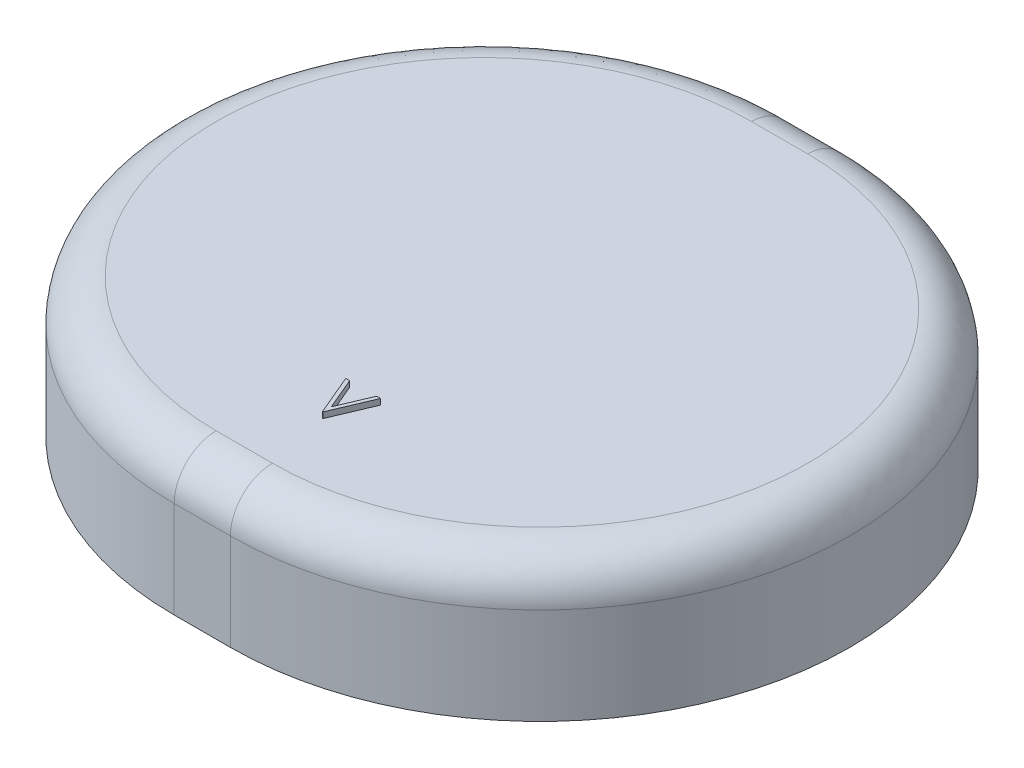
ISO-10303-21;
HEADER;
FILE_DESCRIPTION(('STEP AP214'),'2;1');
FILE_NAME('part.step','',(''),(''),'','','');
FILE_SCHEMA(('AUTOMOTIVE_DESIGN { 1 0 10303 214 1 1 1 1 }'));
ENDSEC;
DATA;
#1=APPLICATION_CONTEXT('core data for automotive mechanical design processes');
#2=APPLICATION_PROTOCOL_DEFINITION('international standard','automotive_design',2000,#1);
#3=PRODUCT_CONTEXT('',#1,'mechanical');
#4=PRODUCT('Part','Part','',(#3));
#5=PRODUCT_RELATED_PRODUCT_CATEGORY('part','',(#4));
#6=PRODUCT_DEFINITION_FORMATION('','',#4);
#7=PRODUCT_DEFINITION_CONTEXT('part definition',#1,'design');
#8=PRODUCT_DEFINITION('design','',#6,#7);
#9=PRODUCT_DEFINITION_SHAPE('','',#8);
#10=(LENGTH_UNIT() NAMED_UNIT(*) SI_UNIT(.MILLI.,.METRE.));
#11=(NAMED_UNIT(*) PLANE_ANGLE_UNIT() SI_UNIT($,.RADIAN.));
#12=(NAMED_UNIT(*) SI_UNIT($,.STERADIAN.) SOLID_ANGLE_UNIT());
#13=UNCERTAINTY_MEASURE_WITH_UNIT(LENGTH_MEASURE(1.E-05),#10,'distance_accuracy_value','');
#14=(GEOMETRIC_REPRESENTATION_CONTEXT(3) GLOBAL_UNCERTAINTY_ASSIGNED_CONTEXT((#13)) GLOBAL_UNIT_ASSIGNED_CONTEXT((#10,
#11,#12)) REPRESENTATION_CONTEXT('',''));
#15=CARTESIAN_POINT('',(0.,0.,0.));
#16=DIRECTION('',(0.,0.,1.));
#17=DIRECTION('',(1.,0.,0.));
#18=AXIS2_PLACEMENT_3D('',#15,#16,#17);
#19=CARTESIAN_POINT('',(-3.83120353681643,-28.1567575965887,-2.1206852635903));
#20=DIRECTION('',(0.,-1.,0.));
#21=DIRECTION('',(0.,0.,-1.));
#22=AXIS2_PLACEMENT_3D('',#19,#20,#21);
#23=CYLINDRICAL_SURFACE('',#22,26.8329680771375);
#24=DIRECTION('',(0.,1.,0.));
#25=VECTOR('',#24,1.);
#26=CARTESIAN_POINT('',(-3.8248495123189,-19.7953225723688,24.7122820612333));
#27=LINE('',#26,#25);
#28=CARTESIAN_POINT('',(-3.8248495123189,-28.1567575965887,24.7122820612333));
#29=VERTEX_POINT('',#28);
#30=CARTESIAN_POINT('',(-3.8248495123189,-19.7953225723688,24.7122820612333));
#31=VERTEX_POINT('',#30);
#32=EDGE_CURVE('E334',#29,#31,#27,.T.);
#33=ORIENTED_EDGE('',*,*,#32,.T.);
#34=CARTESIAN_POINT('',(-3.83120353681643,-19.7953225723688,-2.1206852635903));
#35=DIRECTION('',(0.,-1.,0.));
#36=DIRECTION('',(0.,0.,-1.));
#37=AXIS2_PLACEMENT_3D('',#34,#35,#36);
#38=CIRCLE('',#37,26.8329680771375);
#39=CARTESIAN_POINT('',(-3.83755756131395,-19.7953225723688,-28.9536525884139));
#40=VERTEX_POINT('',#39);
#41=EDGE_CURVE('E41',#31,#40,#38,.T.);
#42=ORIENTED_EDGE('',*,*,#41,.T.);
#43=DIRECTION('',(0.,1.,0.));
#44=VECTOR('',#43,1.);
#45=CARTESIAN_POINT('',(-3.83755756131395,-19.7953225723688,-28.9536525884139));
#46=LINE('',#45,#44);
#47=CARTESIAN_POINT('',(-3.83755756131395,-28.1567575965887,-28.9536525884139));
#48=VERTEX_POINT('',#47);
#49=EDGE_CURVE('E359',#48,#40,#46,.T.);
#50=ORIENTED_EDGE('',*,*,#49,.F.);
#51=CARTESIAN_POINT('',(-3.83120353681643,-28.1567575965887,-2.1206852635903));
#52=DIRECTION('',(0.,-1.,0.));
#53=DIRECTION('',(0.,0.,-1.));
#54=AXIS2_PLACEMENT_3D('',#51,#52,#53);
#55=CIRCLE('',#54,26.8329680771375);
#56=EDGE_CURVE('E11',#29,#48,#55,.T.);
#57=ORIENTED_EDGE('',*,*,#56,.F.);
#58=EDGE_LOOP('',(#33,#42,#50,#57));
#59=FACE_BOUND('',#58,.T.);
#60=ADVANCED_FACE('F33',(#59),#23,.T.);
#61=CARTESIAN_POINT('',(-3.82484951231885,-19.7953225723688,21.0737170854532));
#62=DIRECTION('',(-1.,0.,0.));
#63=DIRECTION('',(0.,0.,-1.));
#64=AXIS2_PLACEMENT_3D('',#61,#62,#63);
#65=CIRCLE('',#64,3.63856497578008);
#66=CARTESIAN_POINT('',(-3.83120353681643,-28.1567575965887,-2.1206852635903));
#67=DIRECTION('',(0.,-1.,0.));
#68=AXIS1_PLACEMENT('',#66,#67);
#69=SURFACE_OF_REVOLUTION('',#65,#68);
#70=CARTESIAN_POINT('',(-3.82484951231885,-16.1567575965887,21.0737170854532));
#71=VERTEX_POINT('',#70);
#72=EDGE_CURVE('E308',#31,#71,#65,.T.);
#73=ORIENTED_EDGE('',*,*,#72,.T.);
#74=CARTESIAN_POINT('',(-3.83120353681643,-16.1567575965887,-2.1206852635903));
#75=DIRECTION('',(0.,-1.,0.));
#76=DIRECTION('',(0.,0.,-1.));
#77=AXIS2_PLACEMENT_3D('',#74,#75,#76);
#78=CIRCLE('',#77,23.1944032193748);
#79=CARTESIAN_POINT('',(-3.837557561314,-16.1567575965887,-25.3150876126338));
#80=VERTEX_POINT('',#79);
#81=EDGE_CURVE('E329',#71,#80,#78,.T.);
#82=ORIENTED_EDGE('',*,*,#81,.T.);
#83=CARTESIAN_POINT('',(-3.837557561314,-19.7953225723688,-25.3150876126338));
#84=DIRECTION('',(1.,0.,0.));
#85=DIRECTION('',(0.,0.,1.));
#86=AXIS2_PLACEMENT_3D('',#83,#84,#85);
#87=CIRCLE('',#86,3.63856497578008);
#88=EDGE_CURVE('E356',#40,#80,#87,.T.);
#89=ORIENTED_EDGE('',*,*,#88,.F.);
#90=ORIENTED_EDGE('',*,*,#41,.F.);
#91=EDGE_LOOP('',(#73,#82,#89,#90));
#92=FACE_BOUND('',#91,.T.);
#93=ADVANCED_FACE('F316',(#92),#69,.F.);
#94=CARTESIAN_POINT('',(-3.82484951231885,-19.7953225723688,21.0737170854532));
#95=DIRECTION('',(1.,0.,0.));
#96=DIRECTION('',(0.,0.,1.));
#97=AXIS2_PLACEMENT_3D('',#94,#95,#96);
#98=CIRCLE('',#97,2.63856497578008);
#99=CARTESIAN_POINT('',(-3.83120353681643,-28.1567575965887,-2.1206852635903));
#100=DIRECTION('',(0.,-1.,0.));
#101=AXIS1_PLACEMENT('',#99,#100);
#102=SURFACE_OF_REVOLUTION('',#98,#101);
#103=CARTESIAN_POINT('',(-3.82484951231885,-17.1567575965887,21.0737170854532));
#104=VERTEX_POINT('',#103);
#105=CARTESIAN_POINT('',(-3.82484951231889,-19.7953225723688,23.7122820612333));
#106=VERTEX_POINT('',#105);
#107=EDGE_CURVE('E304',#104,#106,#98,.T.);
#108=ORIENTED_EDGE('',*,*,#107,.T.);
#109=CARTESIAN_POINT('',(-3.83120353681643,-19.7953225723688,-2.1206852635903));
#110=DIRECTION('',(0.,-1.,0.));
#111=DIRECTION('',(0.,0.,-1.));
#112=AXIS2_PLACEMENT_3D('',#109,#110,#111);
#113=CIRCLE('',#112,25.8329681062597);
#114=CARTESIAN_POINT('',(-3.83755756131397,-19.7953225723688,-27.9536525884139));
#115=VERTEX_POINT('',#114);
#116=EDGE_CURVE('E364',#106,#115,#113,.T.);
#117=ORIENTED_EDGE('',*,*,#116,.T.);
#118=CARTESIAN_POINT('',(-3.837557561314,-19.7953225723688,-25.3150876126338));
#119=DIRECTION('',(-1.,0.,0.));
#120=DIRECTION('',(0.,0.,-1.));
#121=AXIS2_PLACEMENT_3D('',#118,#119,#120);
#122=CIRCLE('',#121,2.63856497578008);
#123=CARTESIAN_POINT('',(-3.837557561314,-17.1567575965887,-25.3150876126338));
#124=VERTEX_POINT('',#123);
#125=EDGE_CURVE('E353',#124,#115,#122,.T.);
#126=ORIENTED_EDGE('',*,*,#125,.F.);
#127=CARTESIAN_POINT('',(-3.83120353681643,-17.1567575965887,-2.1206852635903));
#128=DIRECTION('',(0.,-1.,0.));
#129=DIRECTION('',(0.,0.,-1.));
#130=AXIS2_PLACEMENT_3D('',#127,#128,#129);
#131=CIRCLE('',#130,23.1944032193748);
#132=EDGE_CURVE('E367',#104,#124,#131,.T.);
#133=ORIENTED_EDGE('',*,*,#132,.F.);
#134=EDGE_LOOP('',(#108,#117,#126,#133));
#135=FACE_BOUND('',#134,.T.);
#136=ADVANCED_FACE('F312',(#135),#102,.F.);
#137=CARTESIAN_POINT('',(-3.83120353681643,-28.1567575965887,-2.1206852635903));
#138=DIRECTION('',(0.,-1.,0.));
#139=DIRECTION('',(0.,0.,-1.));
#140=AXIS2_PLACEMENT_3D('',#137,#138,#139);
#141=CYLINDRICAL_SURFACE('',#140,25.8329681062597);
#142=DIRECTION('',(0.,-1.,0.));
#143=VECTOR('',#142,1.);
#144=CARTESIAN_POINT('',(-3.82484951231889,-28.1567575965887,23.7122820612333));
#145=LINE('',#144,#143);
#146=CARTESIAN_POINT('',(-3.82484951231889,-28.1567575965887,23.7122820612333));
#147=VERTEX_POINT('',#146);
#148=EDGE_CURVE('E301',#106,#147,#145,.T.);
#149=ORIENTED_EDGE('',*,*,#148,.T.);
#150=CARTESIAN_POINT('',(-3.83120353681643,-28.1567575965887,-2.1206852635903));
#151=DIRECTION('',(0.,-1.,0.));
#152=DIRECTION('',(0.,0.,-1.));
#153=AXIS2_PLACEMENT_3D('',#150,#151,#152);
#154=CIRCLE('',#153,25.8329681062597);
#155=CARTESIAN_POINT('',(-3.83755756131397,-28.1567575965887,-27.9536525884139));
#156=VERTEX_POINT('',#155);
#157=EDGE_CURVE('E361',#147,#156,#154,.T.);
#158=ORIENTED_EDGE('',*,*,#157,.T.);
#159=DIRECTION('',(0.,-1.,0.));
#160=VECTOR('',#159,1.);
#161=CARTESIAN_POINT('',(-3.83755756131397,-28.1567575965887,-27.9536525884139));
#162=LINE('',#161,#160);
#163=EDGE_CURVE('E350',#115,#156,#162,.T.);
#164=ORIENTED_EDGE('',*,*,#163,.F.);
#165=ORIENTED_EDGE('',*,*,#116,.F.);
#166=EDGE_LOOP('',(#149,#158,#164,#165));
#167=FACE_BOUND('',#166,.T.);
#168=ADVANCED_FACE('F315',(#167),#141,.F.);
#169=CARTESIAN_POINT('',(1.04526070176841,-19.7953225723688,24.7110841970468));
#170=DIRECTION('',(0.000245962431565784,0.,0.999999969751241));
#171=DIRECTION('',(0.999999969751241,0.,-0.000245962431565784));
#172=AXIS2_PLACEMENT_3D('',#169,#170,#171);
#173=PLANE('',#172);
#174=DIRECTION('',(0.,1.,0.));
#175=VECTOR('',#174,1.);
#176=CARTESIAN_POINT('',(1.04526070176841,-19.7953225723688,24.7110841970468));
#177=LINE('',#176,#175);
#178=CARTESIAN_POINT('',(1.04526070176841,-28.1567575965887,24.7110841970468));
#179=VERTEX_POINT('',#178);
#180=CARTESIAN_POINT('',(1.04526070176841,-19.7953225723688,24.7110841970468));
#181=VERTEX_POINT('',#180);
#182=EDGE_CURVE('E280',#179,#181,#177,.T.);
#183=ORIENTED_EDGE('',*,*,#182,.T.);
#184=DIRECTION('',(-0.999999969751241,0.,0.000245962431565784));
#185=VECTOR('',#184,1.);
#186=CARTESIAN_POINT('',(1.04526070176841,-19.7953225723688,24.7110841970468));
#187=LINE('',#186,#185);
#188=EDGE_CURVE('E338',#181,#31,#187,.T.);
#189=ORIENTED_EDGE('',*,*,#188,.T.);
#190=ORIENTED_EDGE('',*,*,#32,.F.);
#191=DIRECTION('',(-0.999999969751241,0.,0.000245962431565784));
#192=VECTOR('',#191,1.);
#193=CARTESIAN_POINT('',(1.04526070176841,-28.1567575965887,24.7110841970468));
#194=LINE('',#193,#192);
#195=EDGE_CURVE('E341',#179,#29,#194,.T.);
#196=ORIENTED_EDGE('',*,*,#195,.F.);
#197=EDGE_LOOP('',(#183,#189,#190,#196));
#198=FACE_BOUND('',#197,.T.);
#199=ADVANCED_FACE('F416',(#198),#173,.T.);
#200=CARTESIAN_POINT('',(1.04526070176846,-19.7953225723688,21.0725192212667));
#201=DIRECTION('',(-1.,0.,0.));
#202=DIRECTION('',(0.,0.,-1.));
#203=AXIS2_PLACEMENT_3D('',#200,#201,#202);
#204=CIRCLE('',#203,3.63856497578008);
#205=DIRECTION('',(-0.999999969751241,0.,0.000245962431565784));
#206=VECTOR('',#205,1.);
#207=SURFACE_OF_LINEAR_EXTRUSION('',#204,#206);
#208=CARTESIAN_POINT('',(1.04526070176846,-16.1567575965887,21.0725192212667));
#209=VERTEX_POINT('',#208);
#210=EDGE_CURVE('E275',#181,#209,#204,.T.);
#211=ORIENTED_EDGE('',*,*,#210,.T.);
#212=DIRECTION('',(-0.999999969751241,0.,0.000245962431565784));
#213=VECTOR('',#212,1.);
#214=CARTESIAN_POINT('',(1.04526070176846,-16.1567575965887,21.0725192212667));
#215=LINE('',#214,#213);
#216=EDGE_CURVE('E335',#209,#71,#215,.T.);
#217=ORIENTED_EDGE('',*,*,#216,.T.);
#218=ORIENTED_EDGE('',*,*,#72,.F.);
#219=ORIENTED_EDGE('',*,*,#188,.F.);
#220=EDGE_LOOP('',(#211,#217,#218,#219));
#221=FACE_BOUND('',#220,.T.);
#222=ADVANCED_FACE('F267',(#221),#207,.T.);
#223=CARTESIAN_POINT('',(1.04526070176846,-19.7953225723688,21.0725192212667));
#224=DIRECTION('',(1.,0.,0.));
#225=DIRECTION('',(0.,0.,1.));
#226=AXIS2_PLACEMENT_3D('',#223,#224,#225);
#227=CIRCLE('',#226,2.63856497578008);
#228=DIRECTION('',(-0.999999969751241,0.,0.000245962431565784));
#229=VECTOR('',#228,1.);
#230=SURFACE_OF_LINEAR_EXTRUSION('',#227,#229);
#231=CARTESIAN_POINT('',(1.04526070176846,-17.1567575965887,21.0725192212667));
#232=VERTEX_POINT('',#231);
#233=CARTESIAN_POINT('',(1.04526070176842,-19.7953225723688,23.7110841970468));
#234=VERTEX_POINT('',#233);
#235=EDGE_CURVE('E271',#232,#234,#227,.T.);
#236=ORIENTED_EDGE('',*,*,#235,.T.);
#237=DIRECTION('',(-0.999999969751241,0.,0.000245962431565784));
#238=VECTOR('',#237,1.);
#239=CARTESIAN_POINT('',(1.04526070176842,-19.7953225723688,23.7110841970468));
#240=LINE('',#239,#238);
#241=EDGE_CURVE('E344',#234,#106,#240,.T.);
#242=ORIENTED_EDGE('',*,*,#241,.T.);
#243=ORIENTED_EDGE('',*,*,#107,.F.);
#244=DIRECTION('',(-0.999999969751241,0.,0.000245962431565784));
#245=VECTOR('',#244,1.);
#246=CARTESIAN_POINT('',(1.04526070176846,-17.1567575965887,21.0725192212667));
#247=LINE('',#246,#245);
#248=EDGE_CURVE('E339',#232,#104,#247,.T.);
#249=ORIENTED_EDGE('',*,*,#248,.F.);
#250=EDGE_LOOP('',(#236,#242,#243,#249));
#251=FACE_BOUND('',#250,.T.);
#252=ADVANCED_FACE('F262',(#251),#230,.T.);
#253=CARTESIAN_POINT('',(1.04526070176842,-28.1567575965887,23.7110841970468));
#254=DIRECTION('',(-0.000245962431565784,0.,-0.999999969751241));
#255=DIRECTION('',(-0.999999969751241,0.,0.000245962431565784));
#256=AXIS2_PLACEMENT_3D('',#253,#254,#255);
#257=PLANE('',#256);
#258=DIRECTION('',(0.,-1.,0.));
#259=VECTOR('',#258,1.);
#260=CARTESIAN_POINT('',(1.04526070176842,-28.1567575965887,23.7110841970468));
#261=LINE('',#260,#259);
#262=CARTESIAN_POINT('',(1.04526070176842,-28.1567575965887,23.7110841970468));
#263=VERTEX_POINT('',#262);
#264=EDGE_CURVE('E276',#234,#263,#261,.T.);
#265=ORIENTED_EDGE('',*,*,#264,.T.);
#266=DIRECTION('',(-0.999999969751241,0.,0.000245962431565784));
#267=VECTOR('',#266,1.);
#268=CARTESIAN_POINT('',(1.04526070176842,-28.1567575965887,23.7110841970468));
#269=LINE('',#268,#267);
#270=EDGE_CURVE('E410',#263,#147,#269,.T.);
#271=ORIENTED_EDGE('',*,*,#270,.T.);
#272=ORIENTED_EDGE('',*,*,#148,.F.);
#273=ORIENTED_EDGE('',*,*,#241,.F.);
#274=EDGE_LOOP('',(#265,#271,#272,#273));
#275=FACE_BOUND('',#274,.T.);
#276=ADVANCED_FACE('F258',(#275),#257,.T.);
#277=CARTESIAN_POINT('',(1.03890667727089,-28.1567575965887,-2.12188312777679));
#278=DIRECTION('',(0.,-1.,0.));
#279=DIRECTION('',(0.,0.,-1.));
#280=AXIS2_PLACEMENT_3D('',#277,#278,#279);
#281=CYLINDRICAL_SURFACE('',#280,26.8329680771375);
#282=DIRECTION('',(0.,1.,0.));
#283=VECTOR('',#282,1.);
#284=CARTESIAN_POINT('',(1.03255265277298,-19.7953225723688,-28.9548504526004));
#285=LINE('',#284,#283);
#286=CARTESIAN_POINT('',(1.03255265277298,-28.1567575965887,-28.9548504526004));
#287=VERTEX_POINT('',#286);
#288=CARTESIAN_POINT('',(1.03255265277298,-19.7953225723688,-28.9548504526004));
#289=VERTEX_POINT('',#288);
#290=EDGE_CURVE('E223',#287,#289,#285,.T.);
#291=ORIENTED_EDGE('',*,*,#290,.T.);
#292=CARTESIAN_POINT('',(1.03890667727089,-19.7953225723688,-2.12188312777679));
#293=DIRECTION('',(0.,-1.,0.));
#294=DIRECTION('',(0.,0.,-1.));
#295=AXIS2_PLACEMENT_3D('',#292,#293,#294);
#296=CIRCLE('',#295,26.8329680771375);
#297=EDGE_CURVE('E295',#289,#181,#296,.T.);
#298=ORIENTED_EDGE('',*,*,#297,.T.);
#299=ORIENTED_EDGE('',*,*,#182,.F.);
#300=CARTESIAN_POINT('',(1.03890667727089,-28.1567575965887,-2.12188312777679));
#301=DIRECTION('',(0.,-1.,0.));
#302=DIRECTION('',(0.,0.,-1.));
#303=AXIS2_PLACEMENT_3D('',#300,#301,#302);
#304=CIRCLE('',#303,26.8329680771375);
#305=EDGE_CURVE('E298',#287,#179,#304,.T.);
#306=ORIENTED_EDGE('',*,*,#305,.F.);
#307=EDGE_LOOP('',(#291,#298,#299,#306));
#308=FACE_BOUND('',#307,.T.);
#309=ADVANCED_FACE('F253',(#308),#281,.T.);
#310=CARTESIAN_POINT('',(1.03255265277298,-19.7953225723688,-25.3162854768203));
#311=DIRECTION('',(1.,0.,0.));
#312=DIRECTION('',(0.,0.,1.));
#313=AXIS2_PLACEMENT_3D('',#310,#311,#312);
#314=CIRCLE('',#313,3.63856497578008);
#315=CARTESIAN_POINT('',(1.03890667727089,-28.1567575965887,-2.12188312777679));
#316=DIRECTION('',(0.,-1.,0.));
#317=AXIS1_PLACEMENT('',#315,#316);
#318=SURFACE_OF_REVOLUTION('',#314,#317);
#319=CARTESIAN_POINT('',(1.03255265277298,-16.1567575965887,-25.3162854768203));
#320=VERTEX_POINT('',#319);
#321=EDGE_CURVE('E235',#289,#320,#314,.T.);
#322=ORIENTED_EDGE('',*,*,#321,.T.);
#323=CARTESIAN_POINT('',(1.03890667727089,-16.1567575965887,-2.12188312777679));
#324=DIRECTION('',(0.,-1.,0.));
#325=DIRECTION('',(0.,0.,-1.));
#326=AXIS2_PLACEMENT_3D('',#323,#324,#325);
#327=CIRCLE('',#326,23.1944032193748);
#328=EDGE_CURVE('E292',#320,#209,#327,.T.);
#329=ORIENTED_EDGE('',*,*,#328,.T.);
#330=ORIENTED_EDGE('',*,*,#210,.F.);
#331=ORIENTED_EDGE('',*,*,#297,.F.);
#332=EDGE_LOOP('',(#322,#329,#330,#331));
#333=FACE_BOUND('',#332,.T.);
#334=ADVANCED_FACE('F248',(#333),#318,.F.);
#335=CARTESIAN_POINT('',(1.03255265277298,-19.7953225723688,-25.3162854768203));
#336=DIRECTION('',(-1.,0.,0.));
#337=DIRECTION('',(0.,0.,-1.));
#338=AXIS2_PLACEMENT_3D('',#335,#336,#337);
#339=CIRCLE('',#338,2.63856497578008);
#340=CARTESIAN_POINT('',(1.03890667727089,-28.1567575965887,-2.12188312777679));
#341=DIRECTION('',(0.,-1.,0.));
#342=AXIS1_PLACEMENT('',#340,#341);
#343=SURFACE_OF_REVOLUTION('',#339,#342);
#344=CARTESIAN_POINT('',(1.03255265277298,-17.1567575965887,-25.3162854768203));
#345=VERTEX_POINT('',#344);
#346=CARTESIAN_POINT('',(1.03255265277298,-19.7953225723688,-27.9548504526004));
#347=VERTEX_POINT('',#346);
#348=EDGE_CURVE('E239',#345,#347,#339,.T.);
#349=ORIENTED_EDGE('',*,*,#348,.T.);
#350=CARTESIAN_POINT('',(1.03890667727089,-19.7953225723688,-2.12188312777679));
#351=DIRECTION('',(0.,-1.,0.));
#352=DIRECTION('',(0.,0.,-1.));
#353=AXIS2_PLACEMENT_3D('',#350,#351,#352);
#354=CIRCLE('',#353,25.8329681062597);
#355=EDGE_CURVE('E286',#347,#234,#354,.T.);
#356=ORIENTED_EDGE('',*,*,#355,.T.);
#357=ORIENTED_EDGE('',*,*,#235,.F.);
#358=CARTESIAN_POINT('',(1.03890667727089,-17.1567575965887,-2.12188312777679));
#359=DIRECTION('',(0.,-1.,0.));
#360=DIRECTION('',(0.,0.,-1.));
#361=AXIS2_PLACEMENT_3D('',#358,#359,#360);
#362=CIRCLE('',#361,23.1944032193748);
#363=EDGE_CURVE('E289',#345,#232,#362,.T.);
#364=ORIENTED_EDGE('',*,*,#363,.F.);
#365=EDGE_LOOP('',(#349,#356,#357,#364));
#366=FACE_BOUND('',#365,.T.);
#367=ADVANCED_FACE('F252',(#366),#343,.F.);
#368=CARTESIAN_POINT('',(1.03890667727089,-28.1567575965887,-2.12188312777679));
#369=DIRECTION('',(0.,-1.,0.));
#370=DIRECTION('',(0.,0.,-1.));
#371=AXIS2_PLACEMENT_3D('',#368,#369,#370);
#372=CYLINDRICAL_SURFACE('',#371,25.8329681062597);
#373=DIRECTION('',(0.,-1.,0.));
#374=VECTOR('',#373,1.);
#375=CARTESIAN_POINT('',(1.03255265277298,-28.1567575965887,-27.9548504526004));
#376=LINE('',#375,#374);
#377=CARTESIAN_POINT('',(1.03255265277298,-28.1567575965887,-27.9548504526004));
#378=VERTEX_POINT('',#377);
#379=EDGE_CURVE('E379',#347,#378,#376,.T.);
#380=ORIENTED_EDGE('',*,*,#379,.T.);
#381=CARTESIAN_POINT('',(1.03890667727089,-28.1567575965887,-2.12188312777679));
#382=DIRECTION('',(0.,-1.,0.));
#383=DIRECTION('',(0.,0.,-1.));
#384=AXIS2_PLACEMENT_3D('',#381,#382,#383);
#385=CIRCLE('',#384,25.8329681062597);
#386=EDGE_CURVE('E283',#378,#263,#385,.T.);
#387=ORIENTED_EDGE('',*,*,#386,.T.);
#388=ORIENTED_EDGE('',*,*,#264,.F.);
#389=ORIENTED_EDGE('',*,*,#355,.F.);
#390=EDGE_LOOP('',(#380,#387,#388,#389));
#391=FACE_BOUND('',#390,.T.);
#392=ADVANCED_FACE('F577',(#391),#372,.F.);
#393=CARTESIAN_POINT('',(1.03255265277298,-28.1567575965887,-28.9548504526004));
#394=DIRECTION('',(0.,1.,0.));
#395=DIRECTION('',(0.,0.,1.));
#396=AXIS2_PLACEMENT_3D('',#393,#394,#395);
#397=PLANE('',#396);
#398=DIRECTION('',(-0.999999969751241,0.,0.000245962431566988));
#399=VECTOR('',#398,1.);
#400=CARTESIAN_POINT('',(1.03255265277298,-28.1567575965887,-28.9548504526004));
#401=LINE('',#400,#399);
#402=EDGE_CURVE('E57',#287,#48,#401,.T.);
#403=ORIENTED_EDGE('',*,*,#402,.F.);
#404=ORIENTED_EDGE('',*,*,#305,.T.);
#405=ORIENTED_EDGE('',*,*,#195,.T.);
#406=ORIENTED_EDGE('',*,*,#56,.T.);
#407=EDGE_LOOP('',(#403,#404,#405,#406));
#408=FACE_BOUND('',#407,.T.);
#409=DIRECTION('',(-0.999999969751241,0.,0.000245962431566988));
#410=VECTOR('',#409,1.);
#411=CARTESIAN_POINT('',(1.03255265277298,-28.1567575965887,-27.9548504526004));
#412=LINE('',#411,#410);
#413=EDGE_CURVE('E376',#378,#156,#412,.T.);
#414=ORIENTED_EDGE('',*,*,#413,.T.);
#415=ORIENTED_EDGE('',*,*,#157,.F.);
#416=ORIENTED_EDGE('',*,*,#270,.F.);
#417=ORIENTED_EDGE('',*,*,#386,.F.);
#418=EDGE_LOOP('',(#414,#415,#416,#417));
#419=FACE_BOUND('',#418,.T.);
#420=ADVANCED_FACE('F419',(#408,#419),#397,.F.);
#421=CARTESIAN_POINT('',(1.03255265277298,-19.7953225723688,-28.9548504526004));
#422=DIRECTION('',(0.000245962431566988,0.,0.999999969751241));
#423=DIRECTION('',(0.999999969751241,0.,-0.000245962431566988));
#424=AXIS2_PLACEMENT_3D('',#421,#422,#423);
#425=PLANE('',#424);
#426=ORIENTED_EDGE('',*,*,#402,.T.);
#427=ORIENTED_EDGE('',*,*,#49,.T.);
#428=DIRECTION('',(-0.999999969751241,0.,0.000245962431566988));
#429=VECTOR('',#428,1.);
#430=CARTESIAN_POINT('',(1.03255265277298,-19.7953225723688,-28.9548504526004));
#431=LINE('',#430,#429);
#432=EDGE_CURVE('E373',#289,#40,#431,.T.);
#433=ORIENTED_EDGE('',*,*,#432,.F.);
#434=ORIENTED_EDGE('',*,*,#290,.F.);
#435=EDGE_LOOP('',(#426,#427,#433,#434));
#436=FACE_BOUND('',#435,.T.);
#437=ADVANCED_FACE('F422',(#436),#425,.F.);
#438=DIRECTION('',(-0.999999969751241,0.,0.000245962431566988));
#439=VECTOR('',#438,1.);
#440=SURFACE_OF_LINEAR_EXTRUSION('',#314,#439);
#441=ORIENTED_EDGE('',*,*,#432,.T.);
#442=ORIENTED_EDGE('',*,*,#88,.T.);
#443=DIRECTION('',(-0.999999969751241,0.,0.000245962431566988));
#444=VECTOR('',#443,1.);
#445=CARTESIAN_POINT('',(1.03255265277298,-16.1567575965887,-25.3162854768203));
#446=LINE('',#445,#444);
#447=EDGE_CURVE('E383',#320,#80,#446,.T.);
#448=ORIENTED_EDGE('',*,*,#447,.F.);
#449=ORIENTED_EDGE('',*,*,#321,.F.);
#450=EDGE_LOOP('',(#441,#442,#448,#449));
#451=FACE_BOUND('',#450,.T.);
#452=ADVANCED_FACE('F244',(#451),#440,.F.);
#453=CARTESIAN_POINT('',(1.03255265277298,-16.1567575965887,-3.41364967532306));
#454=DIRECTION('',(0.,-1.,0.));
#455=DIRECTION('',(0.,0.,-1.));
#456=AXIS2_PLACEMENT_3D('',#453,#454,#455);
#457=PLANE('',#456);
#458=DIRECTION('',(-1.,0.,0.));
#459=VECTOR('',#458,1.);
#460=CARTESIAN_POINT('',(-0.115888625699717,-16.1567575965887,15.5334416634833));
#461=LINE('',#460,#459);
#462=CARTESIAN_POINT('',(-0.115888625699717,-16.1567575965887,15.5334416634833));
#463=VERTEX_POINT('',#462);
#464=CARTESIAN_POINT('',(-0.160760420571512,-16.1567575965887,15.5334416634833));
#465=VERTEX_POINT('',#464);
#466=EDGE_CURVE('E193',#463,#465,#461,.T.);
#467=ORIENTED_EDGE('',*,*,#466,.T.);
#468=DIRECTION('',(-0.389639990836698,0.,-0.920967251068559));
#469=VECTOR('',#468,1.);
#470=CARTESIAN_POINT('',(-0.160760420571512,-16.1567575965887,15.5334416634833));
#471=LINE('',#470,#469);
#472=CARTESIAN_POINT('',(-1.64152965134074,-16.1567575965887,12.0334416634833));
#473=VERTEX_POINT('',#472);
#474=EDGE_CURVE('E210',#465,#473,#471,.T.);
#475=ORIENTED_EDGE('',*,*,#474,.T.);
#476=DIRECTION('',(1.,0.,0.));
#477=VECTOR('',#476,1.);
#478=CARTESIAN_POINT('',(-1.64152965134074,-16.1567575965887,12.0334416634833));
#479=LINE('',#478,#477);
#480=CARTESIAN_POINT('',(-1.30499118980228,-16.1567575965887,12.0334416634833));
#481=VERTEX_POINT('',#480);
#482=EDGE_CURVE('E172',#473,#481,#479,.T.);
#483=ORIENTED_EDGE('',*,*,#482,.T.);
#484=DIRECTION('',(0.389563616454194,0.,0.920999559573798));
#485=VECTOR('',#484,1.);
#486=CARTESIAN_POINT('',(-1.30499118980228,-16.1567575965887,12.0334416634833));
#487=LINE('',#486,#485);
#488=CARTESIAN_POINT('',(-0.138324523135614,-16.1567575965887,14.7916548045089));
#489=VERTEX_POINT('',#488);
#490=EDGE_CURVE('E49',#481,#489,#487,.T.);
#491=ORIENTED_EDGE('',*,*,#490,.T.);
#492=DIRECTION('',(0.389563616454194,0.,-0.920999559573798));
#493=VECTOR('',#492,1.);
#494=CARTESIAN_POINT('',(-0.138324523135614,-16.1567575965887,14.7916548045089));
#495=LINE('',#494,#493);
#496=CARTESIAN_POINT('',(1.02834214353105,-16.1567575965887,12.0334416634833));
#497=VERTEX_POINT('',#496);
#498=EDGE_CURVE('E214',#489,#497,#495,.T.);
#499=ORIENTED_EDGE('',*,*,#498,.T.);
#500=DIRECTION('',(1.,0.,0.));
#501=VECTOR('',#500,1.);
#502=CARTESIAN_POINT('',(1.02834214353105,-16.1567575965887,12.0334416634833));
#503=LINE('',#502,#501);
#504=CARTESIAN_POINT('',(1.36488060506951,-16.1567575965887,12.0334416634833));
#505=VERTEX_POINT('',#504);
#506=EDGE_CURVE('E217',#497,#505,#503,.T.);
#507=ORIENTED_EDGE('',*,*,#506,.T.);
#508=DIRECTION('',(-0.389639990836698,0.,0.920967251068559));
#509=VECTOR('',#508,1.);
#510=CARTESIAN_POINT('',(1.36488060506951,-16.1567575965887,12.0334416634833));
#511=LINE('',#510,#509);
#512=EDGE_CURVE('E196',#505,#463,#511,.T.);
#513=ORIENTED_EDGE('',*,*,#512,.T.);
#514=EDGE_LOOP('',(#467,#475,#483,#491,#499,#507,#513));
#515=FACE_BOUND('',#514,.T.);
#516=ORIENTED_EDGE('',*,*,#447,.T.);
#517=ORIENTED_EDGE('',*,*,#81,.F.);
#518=ORIENTED_EDGE('',*,*,#216,.F.);
#519=ORIENTED_EDGE('',*,*,#328,.F.);
#520=EDGE_LOOP('',(#516,#517,#518,#519));
#521=FACE_BOUND('',#520,.T.);
#522=ADVANCED_FACE('F426',(#515,#521),#457,.F.);
#523=CARTESIAN_POINT('',(1.03255265277298,-17.1567575965887,-25.3162854768203));
#524=DIRECTION('',(0.,1.,0.));
#525=DIRECTION('',(0.,0.,1.));
#526=AXIS2_PLACEMENT_3D('',#523,#524,#525);
#527=PLANE('',#526);
#528=DIRECTION('',(-0.999999969751241,0.,0.000245962431566988));
#529=VECTOR('',#528,1.);
#530=CARTESIAN_POINT('',(1.03255265277298,-17.1567575965887,-25.3162854768203));
#531=LINE('',#530,#529);
#532=EDGE_CURVE('E387',#345,#124,#531,.T.);
#533=ORIENTED_EDGE('',*,*,#532,.F.);
#534=ORIENTED_EDGE('',*,*,#363,.T.);
#535=ORIENTED_EDGE('',*,*,#248,.T.);
#536=ORIENTED_EDGE('',*,*,#132,.T.);
#537=EDGE_LOOP('',(#533,#534,#535,#536));
#538=FACE_BOUND('',#537,.T.);
#539=ADVANCED_FACE('F428',(#538),#527,.F.);
#540=DIRECTION('',(-0.999999969751241,0.,0.000245962431566988));
#541=VECTOR('',#540,1.);
#542=SURFACE_OF_LINEAR_EXTRUSION('',#339,#541);
#543=ORIENTED_EDGE('',*,*,#532,.T.);
#544=ORIENTED_EDGE('',*,*,#125,.T.);
#545=DIRECTION('',(-0.999999969751241,0.,0.000245962431566988));
#546=VECTOR('',#545,1.);
#547=CARTESIAN_POINT('',(1.03255265277298,-19.7953225723688,-27.9548504526004));
#548=LINE('',#547,#546);
#549=EDGE_CURVE('E378',#347,#115,#548,.T.);
#550=ORIENTED_EDGE('',*,*,#549,.F.);
#551=ORIENTED_EDGE('',*,*,#348,.F.);
#552=EDGE_LOOP('',(#543,#544,#550,#551));
#553=FACE_BOUND('',#552,.T.);
#554=ADVANCED_FACE('F402',(#553),#542,.F.);
#555=CARTESIAN_POINT('',(1.03255265277298,-28.1567575965887,-27.9548504526004));
#556=DIRECTION('',(-0.000245962431566988,0.,-0.999999969751241));
#557=DIRECTION('',(-0.999999969751241,0.,0.000245962431566988));
#558=AXIS2_PLACEMENT_3D('',#555,#556,#557);
#559=PLANE('',#558);
#560=ORIENTED_EDGE('',*,*,#549,.T.);
#561=ORIENTED_EDGE('',*,*,#163,.T.);
#562=ORIENTED_EDGE('',*,*,#413,.F.);
#563=ORIENTED_EDGE('',*,*,#379,.F.);
#564=EDGE_LOOP('',(#560,#561,#562,#563));
#565=FACE_BOUND('',#564,.T.);
#566=ADVANCED_FACE('F395',(#565),#559,.F.);
#567=CARTESIAN_POINT('',(-0.160760420571512,-15.6567575965887,15.5334416634833));
#568=DIRECTION('',(-0.920967251068559,0.,0.389639990836698));
#569=DIRECTION('',(0.389639990836698,0.,0.920967251068559));
#570=AXIS2_PLACEMENT_3D('',#567,#568,#569);
#571=PLANE('',#570);
#572=ORIENTED_EDGE('',*,*,#474,.F.);
#573=DIRECTION('',(0.,-1.,0.));
#574=VECTOR('',#573,1.);
#575=CARTESIAN_POINT('',(-0.160760420571512,-15.6567575965887,15.5334416634833));
#576=LINE('',#575,#574);
#577=CARTESIAN_POINT('',(-0.160760420571512,-15.6567575965887,15.5334416634833));
#578=VERTEX_POINT('',#577);
#579=EDGE_CURVE('E192',#578,#465,#576,.T.);
#580=ORIENTED_EDGE('',*,*,#579,.F.);
#581=DIRECTION('',(-0.389639990836698,0.,-0.920967251068559));
#582=VECTOR('',#581,1.);
#583=CARTESIAN_POINT('',(-0.160760420571512,-15.6567575965887,15.5334416634833));
#584=LINE('',#583,#582);
#585=CARTESIAN_POINT('',(-1.64152965134074,-15.6567575965887,12.0334416634833));
#586=VERTEX_POINT('',#585);
#587=EDGE_CURVE('E185',#578,#586,#584,.T.);
#588=ORIENTED_EDGE('',*,*,#587,.T.);
#589=DIRECTION('',(0.,-1.,0.));
#590=VECTOR('',#589,1.);
#591=CARTESIAN_POINT('',(-1.64152965134074,-15.6567575965887,12.0334416634833));
#592=LINE('',#591,#590);
#593=EDGE_CURVE('E167',#586,#473,#592,.T.);
#594=ORIENTED_EDGE('',*,*,#593,.T.);
#595=EDGE_LOOP('',(#572,#580,#588,#594));
#596=FACE_BOUND('',#595,.T.);
#597=ADVANCED_FACE('F191',(#596),#571,.T.);
#598=CARTESIAN_POINT('',(-0.115888625699717,-15.6567575965887,15.5334416634833));
#599=DIRECTION('',(0.,0.,1.));
#600=DIRECTION('',(0.,-1.,0.));
#601=AXIS2_PLACEMENT_3D('',#598,#599,#600);
#602=PLANE('',#601);
#603=ORIENTED_EDGE('',*,*,#466,.F.);
#604=DIRECTION('',(0.,-1.,0.));
#605=VECTOR('',#604,1.);
#606=CARTESIAN_POINT('',(-0.115888625699717,-15.6567575965887,15.5334416634833));
#607=LINE('',#606,#605);
#608=CARTESIAN_POINT('',(-0.115888625699717,-15.6567575965887,15.5334416634833));
#609=VERTEX_POINT('',#608);
#610=EDGE_CURVE('E224',#609,#463,#607,.T.);
#611=ORIENTED_EDGE('',*,*,#610,.F.);
#612=DIRECTION('',(-1.,0.,0.));
#613=VECTOR('',#612,1.);
#614=CARTESIAN_POINT('',(-0.115888625699717,-15.6567575965887,15.5334416634833));
#615=LINE('',#614,#613);
#616=EDGE_CURVE('E178',#609,#578,#615,.T.);
#617=ORIENTED_EDGE('',*,*,#616,.T.);
#618=ORIENTED_EDGE('',*,*,#579,.T.);
#619=EDGE_LOOP('',(#603,#611,#617,#618));
#620=FACE_BOUND('',#619,.T.);
#621=ADVANCED_FACE('F443',(#620),#602,.T.);
#622=CARTESIAN_POINT('',(1.36488060506951,-15.6567575965887,12.0334416634833));
#623=DIRECTION('',(0.920967251068559,0.,0.389639990836698));
#624=DIRECTION('',(0.389639990836698,0.,-0.920967251068559));
#625=AXIS2_PLACEMENT_3D('',#622,#623,#624);
#626=PLANE('',#625);
#627=ORIENTED_EDGE('',*,*,#512,.F.);
#628=DIRECTION('',(0.,-1.,0.));
#629=VECTOR('',#628,1.);
#630=CARTESIAN_POINT('',(1.36488060506951,-15.6567575965887,12.0334416634833));
#631=LINE('',#630,#629);
#632=CARTESIAN_POINT('',(1.36488060506951,-15.6567575965887,12.0334416634833));
#633=VERTEX_POINT('',#632);
#634=EDGE_CURVE('E226',#633,#505,#631,.T.);
#635=ORIENTED_EDGE('',*,*,#634,.F.);
#636=DIRECTION('',(-0.389639990836698,0.,0.920967251068559));
#637=VECTOR('',#636,1.);
#638=CARTESIAN_POINT('',(1.36488060506951,-15.6567575965887,12.0334416634833));
#639=LINE('',#638,#637);
#640=EDGE_CURVE('E206',#633,#609,#639,.T.);
#641=ORIENTED_EDGE('',*,*,#640,.T.);
#642=ORIENTED_EDGE('',*,*,#610,.T.);
#643=EDGE_LOOP('',(#627,#635,#641,#642));
#644=FACE_BOUND('',#643,.T.);
#645=ADVANCED_FACE('F456',(#644),#626,.T.);
#646=CARTESIAN_POINT('',(1.02834214353105,-15.6567575965887,12.0334416634833));
#647=DIRECTION('',(0.,0.,-1.));
#648=DIRECTION('',(0.,1.,0.));
#649=AXIS2_PLACEMENT_3D('',#646,#647,#648);
#650=PLANE('',#649);
#651=ORIENTED_EDGE('',*,*,#506,.F.);
#652=DIRECTION('',(0.,-1.,0.));
#653=VECTOR('',#652,1.);
#654=CARTESIAN_POINT('',(1.02834214353105,-15.6567575965887,12.0334416634833));
#655=LINE('',#654,#653);
#656=CARTESIAN_POINT('',(1.02834214353105,-15.6567575965887,12.0334416634833));
#657=VERTEX_POINT('',#656);
#658=EDGE_CURVE('E228',#657,#497,#655,.T.);
#659=ORIENTED_EDGE('',*,*,#658,.F.);
#660=DIRECTION('',(1.,0.,0.));
#661=VECTOR('',#660,1.);
#662=CARTESIAN_POINT('',(1.02834214353105,-15.6567575965887,12.0334416634833));
#663=LINE('',#662,#661);
#664=EDGE_CURVE('E203',#657,#633,#663,.T.);
#665=ORIENTED_EDGE('',*,*,#664,.T.);
#666=ORIENTED_EDGE('',*,*,#634,.T.);
#667=EDGE_LOOP('',(#651,#659,#665,#666));
#668=FACE_BOUND('',#667,.T.);
#669=ADVANCED_FACE('F452',(#668),#650,.T.);
#670=CARTESIAN_POINT('',(-0.138324523135614,-15.6567575965887,14.7916548045089));
#671=DIRECTION('',(-0.920999559573798,0.,-0.389563616454194));
#672=DIRECTION('',(-0.389563616454194,0.,0.920999559573798));
#673=AXIS2_PLACEMENT_3D('',#670,#671,#672);
#674=PLANE('',#673);
#675=ORIENTED_EDGE('',*,*,#498,.F.);
#676=DIRECTION('',(0.,-1.,0.));
#677=VECTOR('',#676,1.);
#678=CARTESIAN_POINT('',(-0.138324523135614,-15.6567575965887,14.7916548045089));
#679=LINE('',#678,#677);
#680=CARTESIAN_POINT('',(-0.138324523135614,-15.6567575965887,14.7916548045089));
#681=VERTEX_POINT('',#680);
#682=EDGE_CURVE('E230',#681,#489,#679,.T.);
#683=ORIENTED_EDGE('',*,*,#682,.F.);
#684=DIRECTION('',(0.389563616454194,0.,-0.920999559573798));
#685=VECTOR('',#684,1.);
#686=CARTESIAN_POINT('',(-0.138324523135614,-15.6567575965887,14.7916548045089));
#687=LINE('',#686,#685);
#688=EDGE_CURVE('E200',#681,#657,#687,.T.);
#689=ORIENTED_EDGE('',*,*,#688,.T.);
#690=ORIENTED_EDGE('',*,*,#658,.T.);
#691=EDGE_LOOP('',(#675,#683,#689,#690));
#692=FACE_BOUND('',#691,.T.);
#693=ADVANCED_FACE('F449',(#692),#674,.T.);
#694=CARTESIAN_POINT('',(-1.30499118980228,-15.6567575965887,12.0334416634833));
#695=DIRECTION('',(0.920999559573798,0.,-0.389563616454194));
#696=DIRECTION('',(-0.389563616454194,0.,-0.920999559573798));
#697=AXIS2_PLACEMENT_3D('',#694,#695,#696);
#698=PLANE('',#697);
#699=ORIENTED_EDGE('',*,*,#490,.F.);
#700=DIRECTION('',(0.,-1.,0.));
#701=VECTOR('',#700,1.);
#702=CARTESIAN_POINT('',(-1.30499118980228,-15.6567575965887,12.0334416634833));
#703=LINE('',#702,#701);
#704=CARTESIAN_POINT('',(-1.30499118980228,-15.6567575965887,12.0334416634833));
#705=VERTEX_POINT('',#704);
#706=EDGE_CURVE('E177',#705,#481,#703,.T.);
#707=ORIENTED_EDGE('',*,*,#706,.F.);
#708=DIRECTION('',(0.389563616454194,0.,0.920999559573798));
#709=VECTOR('',#708,1.);
#710=CARTESIAN_POINT('',(-1.30499118980228,-15.6567575965887,12.0334416634833));
#711=LINE('',#710,#709);
#712=EDGE_CURVE('E189',#705,#681,#711,.T.);
#713=ORIENTED_EDGE('',*,*,#712,.T.);
#714=ORIENTED_EDGE('',*,*,#682,.T.);
#715=EDGE_LOOP('',(#699,#707,#713,#714));
#716=FACE_BOUND('',#715,.T.);
#717=ADVANCED_FACE('F446',(#716),#698,.T.);
#718=CARTESIAN_POINT('',(-1.64152965134074,-15.6567575965887,12.0334416634833));
#719=DIRECTION('',(0.,0.,-1.));
#720=DIRECTION('',(0.,1.,0.));
#721=AXIS2_PLACEMENT_3D('',#718,#719,#720);
#722=PLANE('',#721);
#723=ORIENTED_EDGE('',*,*,#482,.F.);
#724=ORIENTED_EDGE('',*,*,#593,.F.);
#725=DIRECTION('',(1.,0.,0.));
#726=VECTOR('',#725,1.);
#727=CARTESIAN_POINT('',(-1.64152965134074,-15.6567575965887,12.0334416634833));
#728=LINE('',#727,#726);
#729=EDGE_CURVE('E170',#586,#705,#728,.T.);
#730=ORIENTED_EDGE('',*,*,#729,.T.);
#731=ORIENTED_EDGE('',*,*,#706,.T.);
#732=EDGE_LOOP('',(#723,#724,#730,#731));
#733=FACE_BOUND('',#732,.T.);
#734=ADVANCED_FACE('F169',(#733),#722,.T.);
#735=CARTESIAN_POINT('',(0.,-15.6567575965887,0.));
#736=DIRECTION('',(0.,-1.,0.));
#737=DIRECTION('',(0.,0.,-1.));
#738=AXIS2_PLACEMENT_3D('',#735,#736,#737);
#739=PLANE('',#738);
#740=ORIENTED_EDGE('',*,*,#587,.F.);
#741=ORIENTED_EDGE('',*,*,#616,.F.);
#742=ORIENTED_EDGE('',*,*,#640,.F.);
#743=ORIENTED_EDGE('',*,*,#664,.F.);
#744=ORIENTED_EDGE('',*,*,#688,.F.);
#745=ORIENTED_EDGE('',*,*,#712,.F.);
#746=ORIENTED_EDGE('',*,*,#729,.F.);
#747=EDGE_LOOP('',(#740,#741,#742,#743,#744,#745,#746));
#748=FACE_BOUND('',#747,.T.);
#749=ADVANCED_FACE('F183',(#748),#739,.F.);
#750=CLOSED_SHELL('',(#60,#93,#136,#168,#199,#222,#252,#276,#309,#334,#367,#392,#420,#437,#452,
#522,#539,#554,#566,#597,#621,#645,#669,#693,#717,#734,#749));
#751=MANIFOLD_SOLID_BREP('B2',#750);
#752=ADVANCED_BREP_SHAPE_REPRESENTATION('',(#18,#751),#14);
#753=SHAPE_DEFINITION_REPRESENTATION(#9,#752);
ENDSEC;
END-ISO-10303-21;
